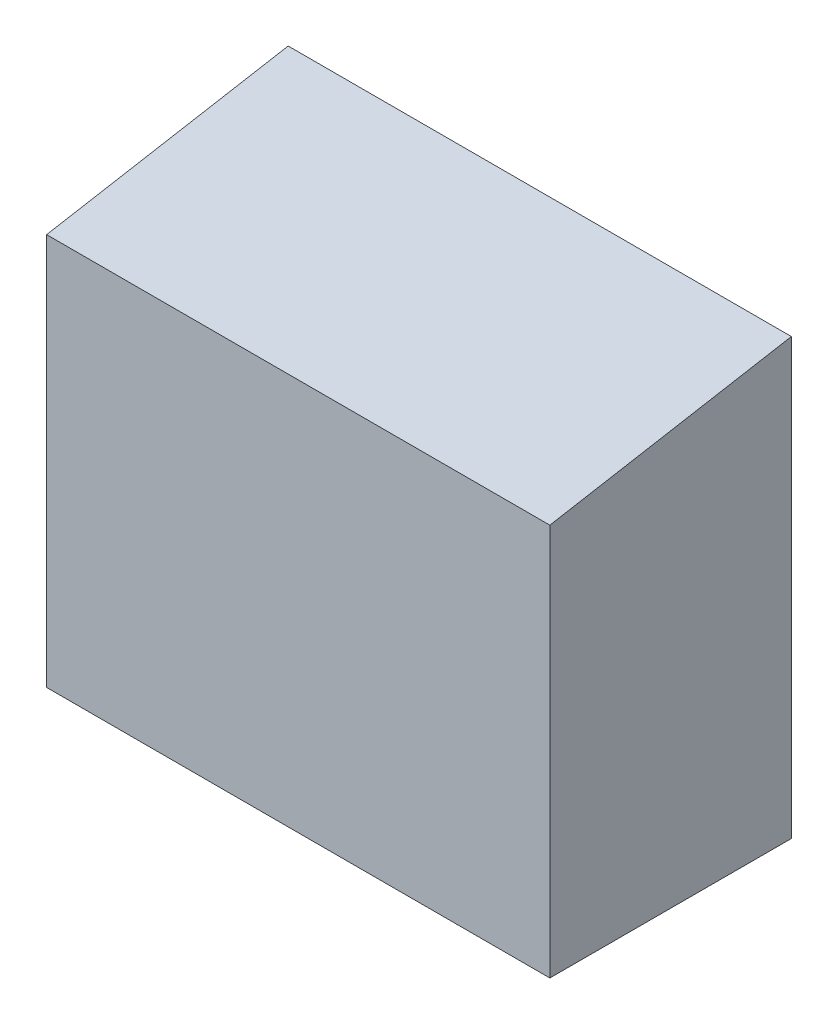
ISO-10303-21;
HEADER;
FILE_DESCRIPTION(('STEP AP214'),'2;1');
FILE_NAME('part.step','',(''),(''),'','','');
FILE_SCHEMA(('AUTOMOTIVE_DESIGN { 1 0 10303 214 1 1 1 1 }'));
ENDSEC;
DATA;
#1=APPLICATION_CONTEXT('core data for automotive mechanical design processes');
#2=APPLICATION_PROTOCOL_DEFINITION('international standard','automotive_design',2000,#1);
#3=PRODUCT_CONTEXT('',#1,'mechanical');
#4=PRODUCT('Part','Part','',(#3));
#5=PRODUCT_RELATED_PRODUCT_CATEGORY('part','',(#4));
#6=PRODUCT_DEFINITION_FORMATION('','',#4);
#7=PRODUCT_DEFINITION_CONTEXT('part definition',#1,'design');
#8=PRODUCT_DEFINITION('design','',#6,#7);
#9=PRODUCT_DEFINITION_SHAPE('','',#8);
#10=(LENGTH_UNIT() NAMED_UNIT(*) SI_UNIT(.MILLI.,.METRE.));
#11=(NAMED_UNIT(*) PLANE_ANGLE_UNIT() SI_UNIT($,.RADIAN.));
#12=(NAMED_UNIT(*) SI_UNIT($,.STERADIAN.) SOLID_ANGLE_UNIT());
#13=UNCERTAINTY_MEASURE_WITH_UNIT(LENGTH_MEASURE(1.E-05),#10,'distance_accuracy_value','');
#14=(GEOMETRIC_REPRESENTATION_CONTEXT(3) GLOBAL_UNCERTAINTY_ASSIGNED_CONTEXT((#13)) GLOBAL_UNIT_ASSIGNED_CONTEXT((#10,
#11,#12)) REPRESENTATION_CONTEXT('',''));
#15=CARTESIAN_POINT('',(0.,0.,0.));
#16=DIRECTION('',(0.,0.,1.));
#17=DIRECTION('',(1.,0.,0.));
#18=AXIS2_PLACEMENT_3D('',#15,#16,#17);
#19=CARTESIAN_POINT('',(39.6875,61.8619420350078,0.));
#20=DIRECTION('',(0.,0.,-1.));
#21=DIRECTION('',(0.,1.,0.));
#22=AXIS2_PLACEMENT_3D('',#19,#20,#21);
#23=PLANE('',#22);
#24=DIRECTION('',(0.,-1.,0.));
#25=VECTOR('',#24,1.);
#26=CARTESIAN_POINT('',(-39.6875,61.8619420350078,0.));
#27=LINE('',#26,#25);
#28=CARTESIAN_POINT('',(-39.6875,61.8619420350078,0.));
#29=VERTEX_POINT('',#28);
#30=CARTESIAN_POINT('',(-39.6875,0.,0.));
#31=VERTEX_POINT('',#30);
#32=EDGE_CURVE('E110',#29,#31,#27,.T.);
#33=ORIENTED_EDGE('',*,*,#32,.T.);
#34=DIRECTION('',(-1.,0.,0.));
#35=VECTOR('',#34,1.);
#36=CARTESIAN_POINT('',(39.6875,0.,0.));
#37=LINE('',#36,#35);
#38=CARTESIAN_POINT('',(39.6875,0.,0.));
#39=VERTEX_POINT('',#38);
#40=EDGE_CURVE('E11',#39,#31,#37,.T.);
#41=ORIENTED_EDGE('',*,*,#40,.F.);
#42=DIRECTION('',(0.,-1.,0.));
#43=VECTOR('',#42,1.);
#44=CARTESIAN_POINT('',(39.6875,61.8619420350078,0.));
#45=LINE('',#44,#43);
#46=CARTESIAN_POINT('',(39.6875,61.8619420350078,0.));
#47=VERTEX_POINT('',#46);
#48=EDGE_CURVE('E111',#47,#39,#45,.T.);
#49=ORIENTED_EDGE('',*,*,#48,.F.);
#50=DIRECTION('',(-1.,0.,0.));
#51=VECTOR('',#50,1.);
#52=CARTESIAN_POINT('',(39.6875,61.8619420350078,0.));
#53=LINE('',#52,#51);
#54=EDGE_CURVE('E117',#47,#29,#53,.T.);
#55=ORIENTED_EDGE('',*,*,#54,.T.);
#56=EDGE_LOOP('',(#33,#41,#49,#55));
#57=FACE_BOUND('',#56,.T.);
#58=ADVANCED_FACE('F35',(#57),#23,.F.);
#59=CARTESIAN_POINT('',(39.6875,0.,0.));
#60=DIRECTION('',(0.,1.,0.));
#61=DIRECTION('',(0.,0.,1.));
#62=AXIS2_PLACEMENT_3D('',#59,#60,#61);
#63=PLANE('',#62);
#64=CARTESIAN_POINT('',(-25.4,0.,-19.05));
#65=DIRECTION('',(0.,-1.,0.));
#66=DIRECTION('',(0.,0.,-1.));
#67=AXIS2_PLACEMENT_3D('',#64,#65,#66);
#68=CIRCLE('',#67,2.55269999999999);
#69=CARTESIAN_POINT('',(-25.4,0.,-21.6027));
#70=VERTEX_POINT('',#69);
#71=EDGE_CURVE('E100',#70,#70,#68,.T.);
#72=ORIENTED_EDGE('',*,*,#71,.F.);
#73=EDGE_LOOP('',(#72));
#74=FACE_BOUND('',#73,.T.);
#75=CARTESIAN_POINT('',(25.4,0.,-19.05));
#76=DIRECTION('',(0.,-1.,0.));
#77=DIRECTION('',(0.,0.,-1.));
#78=AXIS2_PLACEMENT_3D('',#75,#76,#77);
#79=CIRCLE('',#78,2.55269999999999);
#80=CARTESIAN_POINT('',(25.4,0.,-21.6027));
#81=VERTEX_POINT('',#80);
#82=EDGE_CURVE('E99',#81,#81,#79,.T.);
#83=ORIENTED_EDGE('',*,*,#82,.F.);
#84=EDGE_LOOP('',(#83));
#85=FACE_BOUND('',#84,.T.);
#86=DIRECTION('',(0.,0.,-1.));
#87=VECTOR('',#86,1.);
#88=CARTESIAN_POINT('',(-39.6875,0.,0.));
#89=LINE('',#88,#87);
#90=CARTESIAN_POINT('',(-39.6875,0.,-38.1));
#91=VERTEX_POINT('',#90);
#92=EDGE_CURVE('E120',#31,#91,#89,.T.);
#93=ORIENTED_EDGE('',*,*,#92,.T.);
#94=DIRECTION('',(-1.,0.,0.));
#95=VECTOR('',#94,1.);
#96=CARTESIAN_POINT('',(39.6875,0.,-38.1));
#97=LINE('',#96,#95);
#98=CARTESIAN_POINT('',(39.6875,0.,-38.1));
#99=VERTEX_POINT('',#98);
#100=EDGE_CURVE('E43',#99,#91,#97,.T.);
#101=ORIENTED_EDGE('',*,*,#100,.F.);
#102=DIRECTION('',(0.,0.,-1.));
#103=VECTOR('',#102,1.);
#104=CARTESIAN_POINT('',(39.6875,0.,0.));
#105=LINE('',#104,#103);
#106=EDGE_CURVE('E82',#39,#99,#105,.T.);
#107=ORIENTED_EDGE('',*,*,#106,.F.);
#108=ORIENTED_EDGE('',*,*,#40,.T.);
#109=EDGE_LOOP('',(#93,#101,#107,#108));
#110=FACE_BOUND('',#109,.T.);
#111=ADVANCED_FACE('F143',(#74,#85,#110),#63,.F.);
#112=CARTESIAN_POINT('',(39.6875,0.,-38.1));
#113=DIRECTION('',(0.,0.,1.));
#114=DIRECTION('',(0.,-1.,0.));
#115=AXIS2_PLACEMENT_3D('',#112,#113,#114);
#116=PLANE('',#115);
#117=DIRECTION('',(0.,1.,0.));
#118=VECTOR('',#117,1.);
#119=CARTESIAN_POINT('',(-39.6875,0.,-38.1));
#120=LINE('',#119,#118);
#121=CARTESIAN_POINT('',(-39.6875,68.58,-38.1));
#122=VERTEX_POINT('',#121);
#123=EDGE_CURVE('E69',#91,#122,#120,.T.);
#124=ORIENTED_EDGE('',*,*,#123,.T.);
#125=DIRECTION('',(-1.,0.,0.));
#126=VECTOR('',#125,1.);
#127=CARTESIAN_POINT('',(39.6875,68.58,-38.1));
#128=LINE('',#127,#126);
#129=CARTESIAN_POINT('',(39.6875,68.58,-38.1));
#130=VERTEX_POINT('',#129);
#131=EDGE_CURVE('E125',#130,#122,#128,.T.);
#132=ORIENTED_EDGE('',*,*,#131,.F.);
#133=DIRECTION('',(0.,1.,0.));
#134=VECTOR('',#133,1.);
#135=CARTESIAN_POINT('',(39.6875,0.,-38.1));
#136=LINE('',#135,#134);
#137=EDGE_CURVE('E114',#99,#130,#136,.T.);
#138=ORIENTED_EDGE('',*,*,#137,.F.);
#139=ORIENTED_EDGE('',*,*,#100,.T.);
#140=EDGE_LOOP('',(#124,#132,#138,#139));
#141=FACE_BOUND('',#140,.T.);
#142=ADVANCED_FACE('F127',(#141),#116,.F.);
#143=CARTESIAN_POINT('',(39.6875,68.58,-38.1));
#144=DIRECTION('',(0.,-0.984807753012209,-0.173648177666924));
#145=DIRECTION('',(0.,0.173648177666924,-0.984807753012209));
#146=AXIS2_PLACEMENT_3D('',#143,#144,#145);
#147=PLANE('',#146);
#148=DIRECTION('',(0.,-0.173648177666924,0.984807753012209));
#149=VECTOR('',#148,1.);
#150=CARTESIAN_POINT('',(-39.6875,68.58,-38.1));
#151=LINE('',#150,#149);
#152=EDGE_CURVE('E75',#122,#29,#151,.T.);
#153=ORIENTED_EDGE('',*,*,#152,.T.);
#154=ORIENTED_EDGE('',*,*,#54,.F.);
#155=DIRECTION('',(0.,-0.173648177666924,0.984807753012209));
#156=VECTOR('',#155,1.);
#157=CARTESIAN_POINT('',(39.6875,68.58,-38.1));
#158=LINE('',#157,#156);
#159=EDGE_CURVE('E51',#130,#47,#158,.T.);
#160=ORIENTED_EDGE('',*,*,#159,.F.);
#161=ORIENTED_EDGE('',*,*,#131,.T.);
#162=EDGE_LOOP('',(#153,#154,#160,#161));
#163=FACE_BOUND('',#162,.T.);
#164=ADVANCED_FACE('F134',(#163),#147,.F.);
#165=CARTESIAN_POINT('',(39.6875,0.,0.));
#166=DIRECTION('',(1.,0.,0.));
#167=DIRECTION('',(0.,0.,-1.));
#168=AXIS2_PLACEMENT_3D('',#165,#166,#167);
#169=PLANE('',#168);
#170=ORIENTED_EDGE('',*,*,#48,.T.);
#171=ORIENTED_EDGE('',*,*,#106,.T.);
#172=ORIENTED_EDGE('',*,*,#137,.T.);
#173=ORIENTED_EDGE('',*,*,#159,.T.);
#174=EDGE_LOOP('',(#170,#171,#172,#173));
#175=FACE_BOUND('',#174,.T.);
#176=ADVANCED_FACE('F136',(#175),#169,.T.);
#177=CARTESIAN_POINT('',(-39.6875,0.,0.));
#178=DIRECTION('',(1.,0.,0.));
#179=DIRECTION('',(0.,0.,-1.));
#180=AXIS2_PLACEMENT_3D('',#177,#178,#179);
#181=PLANE('',#180);
#182=ORIENTED_EDGE('',*,*,#32,.F.);
#183=ORIENTED_EDGE('',*,*,#152,.F.);
#184=ORIENTED_EDGE('',*,*,#123,.F.);
#185=ORIENTED_EDGE('',*,*,#92,.F.);
#186=EDGE_LOOP('',(#182,#183,#184,#185));
#187=FACE_BOUND('',#186,.T.);
#188=ADVANCED_FACE('F130',(#187),#181,.F.);
#189=CARTESIAN_POINT('',(25.4,22.86,-19.05));
#190=DIRECTION('',(0.,-1.,0.));
#191=DIRECTION('',(0.,0.,-1.));
#192=AXIS2_PLACEMENT_3D('',#189,#190,#191);
#193=CONICAL_SURFACE('',#192,2.55269999999999,1.02974425867665);
#194=CARTESIAN_POINT('',(25.4,24.3938169021917,-19.05));
#195=VERTEX_POINT('',#194);
#196=VERTEX_LOOP('',#195);
#197=FACE_BOUND('',#196,.T.);
#198=CARTESIAN_POINT('',(25.4,22.86,-19.05));
#199=DIRECTION('',(0.,-1.,0.));
#200=DIRECTION('',(0.,0.,-1.));
#201=AXIS2_PLACEMENT_3D('',#198,#199,#200);
#202=CIRCLE('',#201,2.55269999999999);
#203=CARTESIAN_POINT('',(25.4,22.86,-21.6027));
#204=VERTEX_POINT('',#203);
#205=EDGE_CURVE('E103',#204,#204,#202,.T.);
#206=ORIENTED_EDGE('',*,*,#205,.T.);
#207=EDGE_LOOP('',(#206));
#208=FACE_BOUND('',#207,.T.);
#209=ADVANCED_FACE('F158',(#197,#208),#193,.F.);
#210=CARTESIAN_POINT('',(25.4,0.,-19.05));
#211=DIRECTION('',(0.,-1.,0.));
#212=DIRECTION('',(0.,0.,-1.));
#213=AXIS2_PLACEMENT_3D('',#210,#211,#212);
#214=CYLINDRICAL_SURFACE('',#213,2.55269999999999);
#215=ORIENTED_EDGE('',*,*,#205,.F.);
#216=EDGE_LOOP('',(#215));
#217=FACE_BOUND('',#216,.T.);
#218=ORIENTED_EDGE('',*,*,#82,.T.);
#219=EDGE_LOOP('',(#218));
#220=FACE_BOUND('',#219,.T.);
#221=ADVANCED_FACE('F93',(#217,#220),#214,.F.);
#222=CARTESIAN_POINT('',(-25.4,22.86,-19.05));
#223=DIRECTION('',(0.,-1.,0.));
#224=DIRECTION('',(0.,0.,-1.));
#225=AXIS2_PLACEMENT_3D('',#222,#223,#224);
#226=CONICAL_SURFACE('',#225,2.55269999999999,1.02974425867665);
#227=CARTESIAN_POINT('',(-25.4,24.3938169021917,-19.05));
#228=VERTEX_POINT('',#227);
#229=VERTEX_LOOP('',#228);
#230=FACE_BOUND('',#229,.T.);
#231=CARTESIAN_POINT('',(-25.4,22.86,-19.05));
#232=DIRECTION('',(0.,-1.,0.));
#233=DIRECTION('',(0.,0.,-1.));
#234=AXIS2_PLACEMENT_3D('',#231,#232,#233);
#235=CIRCLE('',#234,2.55269999999999);
#236=CARTESIAN_POINT('',(-25.4,22.86,-21.6027));
#237=VERTEX_POINT('',#236);
#238=EDGE_CURVE('E97',#237,#237,#235,.T.);
#239=ORIENTED_EDGE('',*,*,#238,.T.);
#240=EDGE_LOOP('',(#239));
#241=FACE_BOUND('',#240,.T.);
#242=ADVANCED_FACE('F89',(#230,#241),#226,.F.);
#243=CARTESIAN_POINT('',(-25.4,0.,-19.05));
#244=DIRECTION('',(0.,-1.,0.));
#245=DIRECTION('',(0.,0.,-1.));
#246=AXIS2_PLACEMENT_3D('',#243,#244,#245);
#247=CYLINDRICAL_SURFACE('',#246,2.55269999999999);
#248=ORIENTED_EDGE('',*,*,#238,.F.);
#249=EDGE_LOOP('',(#248));
#250=FACE_BOUND('',#249,.T.);
#251=ORIENTED_EDGE('',*,*,#71,.T.);
#252=EDGE_LOOP('',(#251));
#253=FACE_BOUND('',#252,.T.);
#254=ADVANCED_FACE('F92',(#250,#253),#247,.F.);
#255=CLOSED_SHELL('',(#58,#111,#142,#164,#176,#188,#209,#221,#242,#254));
#256=MANIFOLD_SOLID_BREP('B2',#255);
#257=ADVANCED_BREP_SHAPE_REPRESENTATION('',(#18,#256),#14);
#258=SHAPE_DEFINITION_REPRESENTATION(#9,#257);
ENDSEC;
END-ISO-10303-21;
